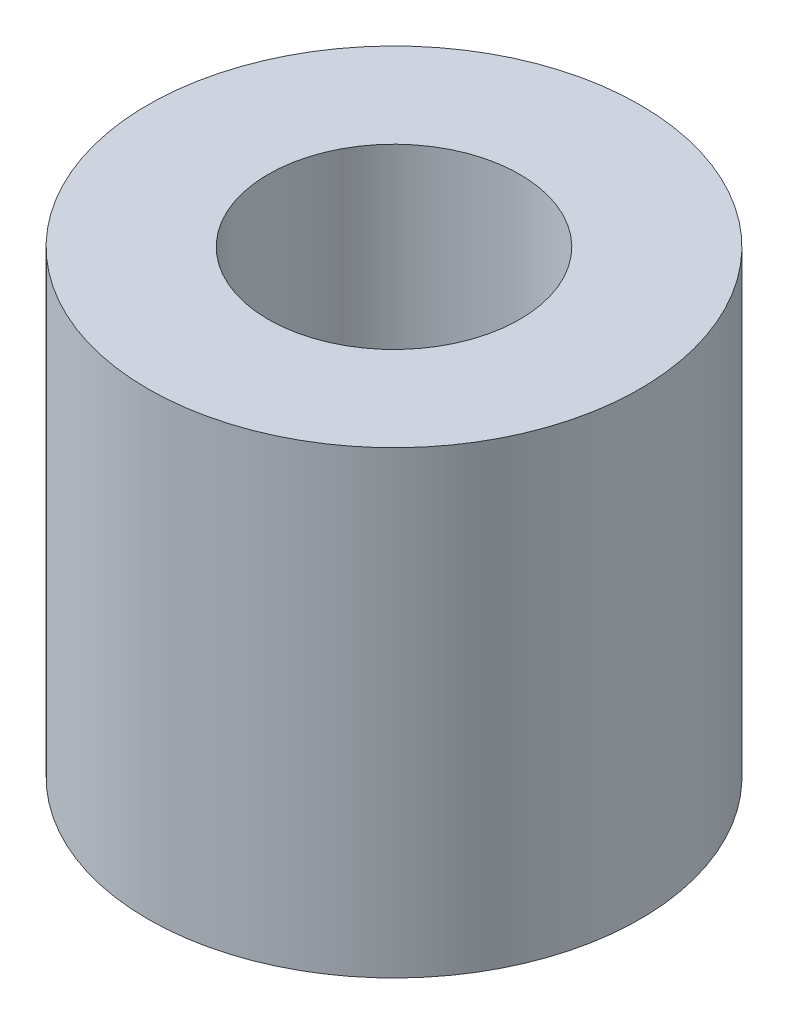
ISO-10303-21;
HEADER;
FILE_DESCRIPTION(('STEP AP214'),'2;1');
FILE_NAME('part.step','',(''),(''),'','','');
FILE_SCHEMA(('AUTOMOTIVE_DESIGN { 1 0 10303 214 1 1 1 1 }'));
ENDSEC;
DATA;
#1=APPLICATION_CONTEXT('core data for automotive mechanical design processes');
#2=APPLICATION_PROTOCOL_DEFINITION('international standard','automotive_design',2000,#1);
#3=PRODUCT_CONTEXT('',#1,'mechanical');
#4=PRODUCT('Part','Part','',(#3));
#5=PRODUCT_RELATED_PRODUCT_CATEGORY('part','',(#4));
#6=PRODUCT_DEFINITION_FORMATION('','',#4);
#7=PRODUCT_DEFINITION_CONTEXT('part definition',#1,'design');
#8=PRODUCT_DEFINITION('design','',#6,#7);
#9=PRODUCT_DEFINITION_SHAPE('','',#8);
#10=(LENGTH_UNIT() NAMED_UNIT(*) SI_UNIT(.MILLI.,.METRE.));
#11=(NAMED_UNIT(*) PLANE_ANGLE_UNIT() SI_UNIT($,.RADIAN.));
#12=(NAMED_UNIT(*) SI_UNIT($,.STERADIAN.) SOLID_ANGLE_UNIT());
#13=UNCERTAINTY_MEASURE_WITH_UNIT(LENGTH_MEASURE(1.E-05),#10,'distance_accuracy_value','');
#14=(GEOMETRIC_REPRESENTATION_CONTEXT(3) GLOBAL_UNCERTAINTY_ASSIGNED_CONTEXT((#13)) GLOBAL_UNIT_ASSIGNED_CONTEXT((#10,
#11,#12)) REPRESENTATION_CONTEXT('',''));
#15=CARTESIAN_POINT('',(0.,0.,0.));
#16=DIRECTION('',(0.,0.,1.));
#17=DIRECTION('',(1.,0.,0.));
#18=AXIS2_PLACEMENT_3D('',#15,#16,#17);
#19=CARTESIAN_POINT('',(7.24999999999998,53.7,-6.55));
#20=DIRECTION('',(0.,1.,0.));
#21=DIRECTION('',(0.,0.,1.));
#22=AXIS2_PLACEMENT_3D('',#19,#20,#21);
#23=CYLINDRICAL_SURFACE('',#22,1.15);
#24=CARTESIAN_POINT('',(7.24999999999998,53.7,-6.55));
#25=DIRECTION('',(0.,1.,0.));
#26=DIRECTION('',(0.,0.,1.));
#27=AXIS2_PLACEMENT_3D('',#24,#25,#26);
#28=CIRCLE('',#27,1.15);
#29=CARTESIAN_POINT('',(7.24999999999998,53.7,-5.4));
#30=VERTEX_POINT('',#29);
#31=EDGE_CURVE('E17',#30,#30,#28,.F.);
#32=ORIENTED_EDGE('',*,*,#31,.F.);
#33=EDGE_LOOP('',(#32));
#34=FACE_BOUND('',#33,.T.);
#35=CARTESIAN_POINT('',(7.24999999999998,49.5,-6.55));
#36=DIRECTION('',(0.,1.,0.));
#37=DIRECTION('',(0.,0.,1.));
#38=AXIS2_PLACEMENT_3D('',#35,#36,#37);
#39=CIRCLE('',#38,1.15);
#40=CARTESIAN_POINT('',(7.24999999999998,49.5,-5.4));
#41=VERTEX_POINT('',#40);
#42=EDGE_CURVE('E26',#41,#41,#39,.F.);
#43=ORIENTED_EDGE('',*,*,#42,.T.);
#44=EDGE_LOOP('',(#43));
#45=FACE_BOUND('',#44,.T.);
#46=ADVANCED_FACE('F14',(#34,#45),#23,.F.);
#47=CARTESIAN_POINT('',(7.24999999999998,53.7,-6.55));
#48=DIRECTION('',(0.,1.,0.));
#49=DIRECTION('',(0.,0.,1.));
#50=AXIS2_PLACEMENT_3D('',#47,#48,#49);
#51=PLANE('',#50);
#52=ORIENTED_EDGE('',*,*,#31,.T.);
#53=EDGE_LOOP('',(#52));
#54=FACE_BOUND('',#53,.T.);
#55=CARTESIAN_POINT('',(7.24999999999998,53.7,-6.55));
#56=DIRECTION('',(0.,1.,0.));
#57=DIRECTION('',(0.,0.,1.));
#58=AXIS2_PLACEMENT_3D('',#55,#56,#57);
#59=CIRCLE('',#58,2.25);
#60=CARTESIAN_POINT('',(7.24999999999998,53.7,-4.3));
#61=VERTEX_POINT('',#60);
#62=EDGE_CURVE('E21',#61,#61,#59,.F.);
#63=ORIENTED_EDGE('',*,*,#62,.F.);
#64=EDGE_LOOP('',(#63));
#65=FACE_BOUND('',#64,.T.);
#66=ADVANCED_FACE('F34',(#54,#65),#51,.T.);
#67=CARTESIAN_POINT('',(7.24999999999998,49.5,-6.55));
#68=DIRECTION('',(0.,1.,0.));
#69=DIRECTION('',(0.,0.,1.));
#70=AXIS2_PLACEMENT_3D('',#67,#68,#69);
#71=PLANE('',#70);
#72=ORIENTED_EDGE('',*,*,#42,.F.);
#73=EDGE_LOOP('',(#72));
#74=FACE_BOUND('',#73,.T.);
#75=CARTESIAN_POINT('',(7.24999999999998,49.5,-6.55));
#76=DIRECTION('',(0.,1.,0.));
#77=DIRECTION('',(0.,0.,1.));
#78=AXIS2_PLACEMENT_3D('',#75,#76,#77);
#79=CIRCLE('',#78,2.25);
#80=CARTESIAN_POINT('',(7.24999999999998,49.5,-4.3));
#81=VERTEX_POINT('',#80);
#82=EDGE_CURVE('E10',#81,#81,#79,.T.);
#83=ORIENTED_EDGE('',*,*,#82,.F.);
#84=EDGE_LOOP('',(#83));
#85=FACE_BOUND('',#84,.T.);
#86=ADVANCED_FACE('F42',(#74,#85),#71,.F.);
#87=CARTESIAN_POINT('',(7.24999999999998,53.7,-6.55));
#88=DIRECTION('',(0.,1.,0.));
#89=DIRECTION('',(0.,0.,1.));
#90=AXIS2_PLACEMENT_3D('',#87,#88,#89);
#91=CYLINDRICAL_SURFACE('',#90,2.25);
#92=ORIENTED_EDGE('',*,*,#62,.T.);
#93=EDGE_LOOP('',(#92));
#94=FACE_BOUND('',#93,.T.);
#95=ORIENTED_EDGE('',*,*,#82,.T.);
#96=EDGE_LOOP('',(#95));
#97=FACE_BOUND('',#96,.T.);
#98=ADVANCED_FACE('F43',(#94,#97),#91,.T.);
#99=CLOSED_SHELL('',(#46,#66,#86,#98));
#100=MANIFOLD_SOLID_BREP('B1',#99);
#101=ADVANCED_BREP_SHAPE_REPRESENTATION('',(#18,#100),#14);
#102=SHAPE_DEFINITION_REPRESENTATION(#9,#101);
ENDSEC;
END-ISO-10303-21;
